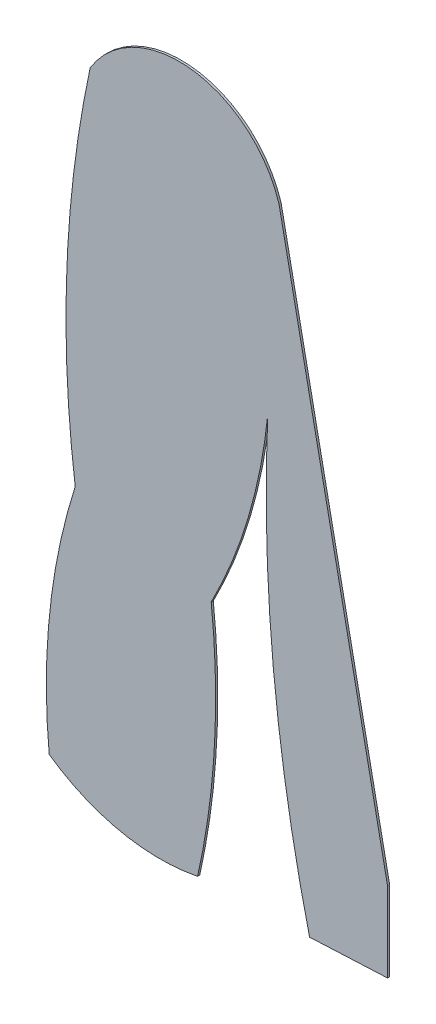
ISO-10303-21;
HEADER;
FILE_DESCRIPTION(('STEP AP214'),'2;1');
FILE_NAME('part.step','',(''),(''),'','','');
FILE_SCHEMA(('AUTOMOTIVE_DESIGN { 1 0 10303 214 1 1 1 1 }'));
ENDSEC;
DATA;
#1=APPLICATION_CONTEXT('core data for automotive mechanical design processes');
#2=APPLICATION_PROTOCOL_DEFINITION('international standard','automotive_design',2000,#1);
#3=PRODUCT_CONTEXT('',#1,'mechanical');
#4=PRODUCT('Part','Part','',(#3));
#5=PRODUCT_RELATED_PRODUCT_CATEGORY('part','',(#4));
#6=PRODUCT_DEFINITION_FORMATION('','',#4);
#7=PRODUCT_DEFINITION_CONTEXT('part definition',#1,'design');
#8=PRODUCT_DEFINITION('design','',#6,#7);
#9=PRODUCT_DEFINITION_SHAPE('','',#8);
#10=(LENGTH_UNIT() NAMED_UNIT(*) SI_UNIT(.MILLI.,.METRE.));
#11=(NAMED_UNIT(*) PLANE_ANGLE_UNIT() SI_UNIT($,.RADIAN.));
#12=(NAMED_UNIT(*) SI_UNIT($,.STERADIAN.) SOLID_ANGLE_UNIT());
#13=UNCERTAINTY_MEASURE_WITH_UNIT(LENGTH_MEASURE(1.E-05),#10,'distance_accuracy_value','');
#14=(GEOMETRIC_REPRESENTATION_CONTEXT(3) GLOBAL_UNCERTAINTY_ASSIGNED_CONTEXT((#13)) GLOBAL_UNIT_ASSIGNED_CONTEXT((#10,
#11,#12)) REPRESENTATION_CONTEXT('',''));
#15=CARTESIAN_POINT('',(0.,0.,0.));
#16=DIRECTION('',(0.,0.,1.));
#17=DIRECTION('',(1.,0.,0.));
#18=AXIS2_PLACEMENT_3D('',#15,#16,#17);
#19=CARTESIAN_POINT('',(27.6029351162744,-1.12530536370908,0.1));
#20=DIRECTION('',(0.,0.,-1.));
#21=DIRECTION('',(-1.,0.,0.));
#22=AXIS2_PLACEMENT_3D('',#19,#20,#21);
#23=CYLINDRICAL_SURFACE('',#22,29.051276035575);
#24=CARTESIAN_POINT('',(27.6029351162744,-1.12530536370908,0.));
#25=DIRECTION('',(0.,0.,1.));
#26=DIRECTION('',(1.,0.,0.));
#27=AXIS2_PLACEMENT_3D('',#24,#25,#26);
#28=CIRCLE('',#27,29.051276035575);
#29=CARTESIAN_POINT('',(-0.0790372467822376,7.68860667273314,0.));
#30=VERTEX_POINT('',#29);
#31=CARTESIAN_POINT('',(-1.31247092155621,-3.93171462868826,0.));
#32=VERTEX_POINT('',#31);
#33=EDGE_CURVE('E141',#30,#32,#28,.T.);
#34=ORIENTED_EDGE('',*,*,#33,.T.);
#35=DIRECTION('',(0.,0.,-1.));
#36=VECTOR('',#35,1.);
#37=CARTESIAN_POINT('',(-1.31247092155621,-3.93171462868826,0.1));
#38=LINE('',#37,#36);
#39=CARTESIAN_POINT('',(-1.31247092155621,-3.93171462868826,0.1));
#40=VERTEX_POINT('',#39);
#41=EDGE_CURVE('E11',#40,#32,#38,.T.);
#42=ORIENTED_EDGE('',*,*,#41,.F.);
#43=CARTESIAN_POINT('',(27.6029351162744,-1.12530536370908,0.1));
#44=DIRECTION('',(0.,0.,1.));
#45=DIRECTION('',(1.,0.,0.));
#46=AXIS2_PLACEMENT_3D('',#43,#44,#45);
#47=CIRCLE('',#46,29.051276035575);
#48=CARTESIAN_POINT('',(-0.0790372467822376,7.68860667273314,0.1));
#49=VERTEX_POINT('',#48);
#50=EDGE_CURVE('E159',#49,#40,#47,.T.);
#51=ORIENTED_EDGE('',*,*,#50,.F.);
#52=DIRECTION('',(0.,0.,-1.));
#53=VECTOR('',#52,1.);
#54=CARTESIAN_POINT('',(-0.0790372467822376,7.68860667273314,0.1));
#55=LINE('',#54,#53);
#56=EDGE_CURVE('E137',#49,#30,#55,.T.);
#57=ORIENTED_EDGE('',*,*,#56,.T.);
#58=EDGE_LOOP('',(#34,#42,#51,#57));
#59=FACE_BOUND('',#58,.T.);
#60=ADVANCED_FACE('F33',(#59),#23,.T.);
#61=CARTESIAN_POINT('',(3.94281642629015,3.52855879331752,0.1));
#62=DIRECTION('',(0.,0.,-1.));
#63=DIRECTION('',(-1.,0.,0.));
#64=AXIS2_PLACEMENT_3D('',#61,#62,#63);
#65=CYLINDRICAL_SURFACE('',#64,9.12544380507161);
#66=CARTESIAN_POINT('',(3.94281642629015,3.52855879331752,0.));
#67=DIRECTION('',(0.,0.,1.));
#68=DIRECTION('',(1.,0.,0.));
#69=AXIS2_PLACEMENT_3D('',#66,#67,#68);
#70=CIRCLE('',#69,9.12544380507161);
#71=CARTESIAN_POINT('',(5.72661164172436,-5.42084338051029,0.));
#72=VERTEX_POINT('',#71);
#73=EDGE_CURVE('E144',#32,#72,#70,.T.);
#74=ORIENTED_EDGE('',*,*,#73,.T.);
#75=DIRECTION('',(0.,0.,-1.));
#76=VECTOR('',#75,1.);
#77=CARTESIAN_POINT('',(5.72661164172436,-5.42084338051029,0.1));
#78=LINE('',#77,#76);
#79=CARTESIAN_POINT('',(5.72661164172436,-5.42084338051029,0.1));
#80=VERTEX_POINT('',#79);
#81=EDGE_CURVE('E41',#80,#72,#78,.T.);
#82=ORIENTED_EDGE('',*,*,#81,.F.);
#83=CARTESIAN_POINT('',(3.94281642629015,3.52855879331752,0.1));
#84=DIRECTION('',(0.,0.,1.));
#85=DIRECTION('',(1.,0.,0.));
#86=AXIS2_PLACEMENT_3D('',#83,#84,#85);
#87=CIRCLE('',#86,9.12544380507161);
#88=EDGE_CURVE('E98',#40,#80,#87,.T.);
#89=ORIENTED_EDGE('',*,*,#88,.F.);
#90=ORIENTED_EDGE('',*,*,#41,.T.);
#91=EDGE_LOOP('',(#74,#82,#89,#90));
#92=FACE_BOUND('',#91,.T.);
#93=ADVANCED_FACE('F208',(#92),#65,.T.);
#94=CARTESIAN_POINT('',(-28.8733615968749,2.31607077777754,0.1));
#95=DIRECTION('',(0.,0.,-1.));
#96=DIRECTION('',(-1.,0.,0.));
#97=AXIS2_PLACEMENT_3D('',#94,#95,#96);
#98=CYLINDRICAL_SURFACE('',#97,35.4544494923346);
#99=CARTESIAN_POINT('',(-28.8733615968749,2.31607077777754,0.));
#100=DIRECTION('',(0.,0.,1.));
#101=DIRECTION('',(1.,0.,0.));
#102=AXIS2_PLACEMENT_3D('',#99,#100,#101);
#103=CIRCLE('',#102,35.4544494923346);
#104=CARTESIAN_POINT('',(6.37117830799491,6.16839419339819,0.));
#105=VERTEX_POINT('',#104);
#106=EDGE_CURVE('E146',#72,#105,#103,.T.);
#107=ORIENTED_EDGE('',*,*,#106,.T.);
#108=DIRECTION('',(0.,0.,-1.));
#109=VECTOR('',#108,1.);
#110=CARTESIAN_POINT('',(6.37117830799491,6.16839419339819,0.1));
#111=LINE('',#110,#109);
#112=CARTESIAN_POINT('',(6.37117830799491,6.16839419339819,0.1));
#113=VERTEX_POINT('',#112);
#114=EDGE_CURVE('E172',#113,#105,#111,.T.);
#115=ORIENTED_EDGE('',*,*,#114,.F.);
#116=CARTESIAN_POINT('',(-28.8733615968749,2.31607077777754,0.1));
#117=DIRECTION('',(0.,0.,1.));
#118=DIRECTION('',(1.,0.,0.));
#119=AXIS2_PLACEMENT_3D('',#116,#117,#118);
#120=CIRCLE('',#119,35.4544494923346);
#121=EDGE_CURVE('E180',#80,#113,#120,.T.);
#122=ORIENTED_EDGE('',*,*,#121,.F.);
#123=ORIENTED_EDGE('',*,*,#81,.T.);
#124=EDGE_LOOP('',(#107,#115,#122,#123));
#125=FACE_BOUND('',#124,.T.);
#126=ADVANCED_FACE('F178',(#125),#98,.T.);
#127=CARTESIAN_POINT('',(-15.9933771732739,17.7204776562566,0.1));
#128=DIRECTION('',(0.,0.,-1.));
#129=DIRECTION('',(-1.,0.,0.));
#130=AXIS2_PLACEMENT_3D('',#127,#128,#129);
#131=CYLINDRICAL_SURFACE('',#130,25.1718885705384);
#132=CARTESIAN_POINT('',(-15.9933771732739,17.7204776562566,0.));
#133=DIRECTION('',(0.,0.,1.));
#134=DIRECTION('',(1.,0.,0.));
#135=AXIS2_PLACEMENT_3D('',#132,#133,#134);
#136=CIRCLE('',#135,25.1718885705384);
#137=CARTESIAN_POINT('',(9.05259312207818,15.2058512084636,0.));
#138=VERTEX_POINT('',#137);
#139=EDGE_CURVE('E148',#105,#138,#136,.T.);
#140=ORIENTED_EDGE('',*,*,#139,.T.);
#141=DIRECTION('',(0.,0.,-1.));
#142=VECTOR('',#141,1.);
#143=CARTESIAN_POINT('',(9.05259312207818,15.2058512084636,0.1));
#144=LINE('',#143,#142);
#145=CARTESIAN_POINT('',(9.05259312207818,15.2058512084636,0.1));
#146=VERTEX_POINT('',#145);
#147=EDGE_CURVE('E169',#146,#138,#144,.T.);
#148=ORIENTED_EDGE('',*,*,#147,.F.);
#149=CARTESIAN_POINT('',(-15.9933771732739,17.7204776562566,0.1));
#150=DIRECTION('',(0.,0.,1.));
#151=DIRECTION('',(1.,0.,0.));
#152=AXIS2_PLACEMENT_3D('',#149,#150,#151);
#153=CIRCLE('',#152,25.1718885705384);
#154=EDGE_CURVE('E198',#113,#146,#153,.T.);
#155=ORIENTED_EDGE('',*,*,#154,.F.);
#156=ORIENTED_EDGE('',*,*,#114,.T.);
#157=EDGE_LOOP('',(#140,#148,#155,#156));
#158=FACE_BOUND('',#157,.T.);
#159=ADVANCED_FACE('F189',(#158),#131,.T.);
#160=CARTESIAN_POINT('',(82.0220836754828,11.9495556707479,0.1));
#161=DIRECTION('',(0.,0.,-1.));
#162=DIRECTION('',(-1.,0.,0.));
#163=AXIS2_PLACEMENT_3D('',#160,#161,#162);
#164=CYLINDRICAL_SURFACE('',#163,73.0421112253223);
#165=CARTESIAN_POINT('',(82.0220836754828,11.9495556707479,0.));
#166=DIRECTION('',(0.,0.,1.));
#167=DIRECTION('',(1.,0.,0.));
#168=AXIS2_PLACEMENT_3D('',#165,#166,#167);
#169=CIRCLE('',#168,73.0421112253223);
#170=CARTESIAN_POINT('',(11.037087709004,-5.26324072877236,0.));
#171=VERTEX_POINT('',#170);
#172=EDGE_CURVE('E150',#138,#171,#169,.T.);
#173=ORIENTED_EDGE('',*,*,#172,.T.);
#174=DIRECTION('',(0.,0.,-1.));
#175=VECTOR('',#174,1.);
#176=CARTESIAN_POINT('',(11.037087709004,-5.26324072877236,0.1));
#177=LINE('',#176,#175);
#178=CARTESIAN_POINT('',(11.037087709004,-5.26324072877236,0.1));
#179=VERTEX_POINT('',#178);
#180=EDGE_CURVE('E166',#179,#171,#177,.T.);
#181=ORIENTED_EDGE('',*,*,#180,.F.);
#182=CARTESIAN_POINT('',(82.0220836754828,11.9495556707479,0.1));
#183=DIRECTION('',(0.,0.,1.));
#184=DIRECTION('',(1.,0.,0.));
#185=AXIS2_PLACEMENT_3D('',#182,#183,#184);
#186=CIRCLE('',#185,73.0421112253223);
#187=EDGE_CURVE('E195',#146,#179,#186,.T.);
#188=ORIENTED_EDGE('',*,*,#187,.F.);
#189=ORIENTED_EDGE('',*,*,#147,.T.);
#190=EDGE_LOOP('',(#173,#181,#188,#189));
#191=FACE_BOUND('',#190,.T.);
#192=ADVANCED_FACE('F193',(#191),#164,.T.);
#193=CARTESIAN_POINT('',(14.7348181349545,-5.09127837500175,0.1));
#194=DIRECTION('',(-0.0464546312392883,0.99892040085105,0.));
#195=DIRECTION('',(-0.99892040085105,-0.0464546312392883,0.));
#196=AXIS2_PLACEMENT_3D('',#193,#194,#195);
#197=PLANE('',#196);
#198=DIRECTION('',(0.99892040085105,0.0464546312392883,0.));
#199=VECTOR('',#198,1.);
#200=CARTESIAN_POINT('',(14.7348181349545,-5.09127837500175,0.));
#201=LINE('',#200,#199);
#202=CARTESIAN_POINT('',(14.7348181349545,-5.09127837500175,0.));
#203=VERTEX_POINT('',#202);
#204=EDGE_CURVE('E152',#171,#203,#201,.T.);
#205=ORIENTED_EDGE('',*,*,#204,.T.);
#206=DIRECTION('',(0.,0.,-1.));
#207=VECTOR('',#206,1.);
#208=CARTESIAN_POINT('',(14.7348181349545,-5.09127837500175,0.1));
#209=LINE('',#208,#207);
#210=CARTESIAN_POINT('',(14.7348181349545,-5.09127837500175,0.1));
#211=VERTEX_POINT('',#210);
#212=EDGE_CURVE('E163',#211,#203,#209,.T.);
#213=ORIENTED_EDGE('',*,*,#212,.F.);
#214=DIRECTION('',(0.99892040085105,0.0464546312392883,0.));
#215=VECTOR('',#214,1.);
#216=CARTESIAN_POINT('',(14.7348181349545,-5.09127837500175,0.1));
#217=LINE('',#216,#215);
#218=EDGE_CURVE('E197',#179,#211,#217,.T.);
#219=ORIENTED_EDGE('',*,*,#218,.F.);
#220=ORIENTED_EDGE('',*,*,#180,.T.);
#221=EDGE_LOOP('',(#205,#213,#219,#220));
#222=FACE_BOUND('',#221,.T.);
#223=ADVANCED_FACE('F220',(#222),#197,.F.);
#224=CARTESIAN_POINT('',(14.7348181349545,-5.09127837500175,0.1));
#225=DIRECTION('',(-1.,0.,0.));
#226=DIRECTION('',(0.,-1.,0.));
#227=AXIS2_PLACEMENT_3D('',#224,#225,#226);
#228=PLANE('',#227);
#229=DIRECTION('',(0.,1.,0.));
#230=VECTOR('',#229,1.);
#231=CARTESIAN_POINT('',(14.7348181349545,-5.09127837500175,0.));
#232=LINE('',#231,#230);
#233=CARTESIAN_POINT('',(14.7348181349545,-1.30379545442513,0.));
#234=VERTEX_POINT('',#233);
#235=EDGE_CURVE('E154',#203,#234,#232,.T.);
#236=ORIENTED_EDGE('',*,*,#235,.T.);
#237=DIRECTION('',(0.,0.,-1.));
#238=VECTOR('',#237,1.);
#239=CARTESIAN_POINT('',(14.7348181349545,-1.30379545442513,0.1));
#240=LINE('',#239,#238);
#241=CARTESIAN_POINT('',(14.7348181349545,-1.30379545442513,0.1));
#242=VERTEX_POINT('',#241);
#243=EDGE_CURVE('E132',#242,#234,#240,.T.);
#244=ORIENTED_EDGE('',*,*,#243,.F.);
#245=DIRECTION('',(0.,1.,0.));
#246=VECTOR('',#245,1.);
#247=CARTESIAN_POINT('',(14.7348181349545,-5.09127837500175,0.1));
#248=LINE('',#247,#246);
#249=EDGE_CURVE('E123',#211,#242,#248,.T.);
#250=ORIENTED_EDGE('',*,*,#249,.F.);
#251=ORIENTED_EDGE('',*,*,#212,.T.);
#252=EDGE_LOOP('',(#236,#244,#250,#251));
#253=FACE_BOUND('',#252,.T.);
#254=ADVANCED_FACE('F223',(#253),#228,.F.);
#255=CARTESIAN_POINT('',(9.58612598334042,24.1332255948705,0.1));
#256=DIRECTION('',(-0.980123910113362,-0.198386291925867,0.));
#257=DIRECTION('',(0.198386291925867,-0.980123910113362,0.));
#258=AXIS2_PLACEMENT_3D('',#255,#256,#257);
#259=PLANE('',#258);
#260=DIRECTION('',(-0.198386291925867,0.980123910113362,0.));
#261=VECTOR('',#260,1.);
#262=CARTESIAN_POINT('',(9.58612598334042,24.1332255948705,0.));
#263=LINE('',#262,#261);
#264=CARTESIAN_POINT('',(9.58612598334042,24.1332255948705,0.));
#265=VERTEX_POINT('',#264);
#266=EDGE_CURVE('E131',#234,#265,#263,.T.);
#267=ORIENTED_EDGE('',*,*,#266,.T.);
#268=DIRECTION('',(0.,0.,-1.));
#269=VECTOR('',#268,1.);
#270=CARTESIAN_POINT('',(9.58612598334042,24.1332255948705,0.1));
#271=LINE('',#270,#269);
#272=CARTESIAN_POINT('',(9.58612598334042,24.1332255948705,0.1));
#273=VERTEX_POINT('',#272);
#274=EDGE_CURVE('E128',#273,#265,#271,.T.);
#275=ORIENTED_EDGE('',*,*,#274,.F.);
#276=DIRECTION('',(-0.198386291925867,0.980123910113362,0.));
#277=VECTOR('',#276,1.);
#278=CARTESIAN_POINT('',(9.58612598334042,24.1332255948705,0.1));
#279=LINE('',#278,#277);
#280=EDGE_CURVE('E117',#242,#273,#279,.T.);
#281=ORIENTED_EDGE('',*,*,#280,.F.);
#282=ORIENTED_EDGE('',*,*,#243,.T.);
#283=EDGE_LOOP('',(#267,#275,#281,#282));
#284=FACE_BOUND('',#283,.T.);
#285=ADVANCED_FACE('F129',(#284),#259,.F.);
#286=CARTESIAN_POINT('',(4.85750321932073,22.6692743671847,0.1));
#287=DIRECTION('',(0.,0.,-1.));
#288=DIRECTION('',(-1.,0.,0.));
#289=AXIS2_PLACEMENT_3D('',#286,#287,#288);
#290=CYLINDRICAL_SURFACE('',#289,4.95005317561822);
#291=CARTESIAN_POINT('',(4.85750321932073,22.6692743671847,0.));
#292=DIRECTION('',(0.,0.,1.));
#293=DIRECTION('',(1.,0.,0.));
#294=AXIS2_PLACEMENT_3D('',#291,#292,#293);
#295=CIRCLE('',#294,4.95005317561822);
#296=CARTESIAN_POINT('',(0.631193943688199,25.2463534013143,0.));
#297=VERTEX_POINT('',#296);
#298=EDGE_CURVE('E84',#265,#297,#295,.T.);
#299=ORIENTED_EDGE('',*,*,#298,.T.);
#300=DIRECTION('',(0.,0.,-1.));
#301=VECTOR('',#300,1.);
#302=CARTESIAN_POINT('',(0.631193943688199,25.2463534013143,0.1));
#303=LINE('',#302,#301);
#304=CARTESIAN_POINT('',(0.631193943688199,25.2463534013143,0.1));
#305=VERTEX_POINT('',#304);
#306=EDGE_CURVE('E133',#305,#297,#303,.T.);
#307=ORIENTED_EDGE('',*,*,#306,.F.);
#308=CARTESIAN_POINT('',(4.85750321932073,22.6692743671847,0.1));
#309=DIRECTION('',(0.,0.,1.));
#310=DIRECTION('',(1.,0.,0.));
#311=AXIS2_PLACEMENT_3D('',#308,#309,#310);
#312=CIRCLE('',#311,4.95005317561822);
#313=EDGE_CURVE('E121',#273,#305,#312,.T.);
#314=ORIENTED_EDGE('',*,*,#313,.F.);
#315=ORIENTED_EDGE('',*,*,#274,.T.);
#316=EDGE_LOOP('',(#299,#307,#314,#315));
#317=FACE_BOUND('',#316,.T.);
#318=ADVANCED_FACE('F135',(#317),#290,.T.);
#319=CARTESIAN_POINT('',(51.2581318379593,14.4051969261997,0.1));
#320=DIRECTION('',(0.,0.,-1.));
#321=DIRECTION('',(-1.,0.,0.));
#322=AXIS2_PLACEMENT_3D('',#319,#320,#321);
#323=CYLINDRICAL_SURFACE('',#322,51.7746802430329);
#324=CARTESIAN_POINT('',(51.2581318379593,14.4051969261997,0.));
#325=DIRECTION('',(0.,0.,1.));
#326=DIRECTION('',(1.,0.,0.));
#327=AXIS2_PLACEMENT_3D('',#324,#325,#326);
#328=CIRCLE('',#327,51.7746802430329);
#329=EDGE_CURVE('E90',#297,#30,#328,.T.);
#330=ORIENTED_EDGE('',*,*,#329,.T.);
#331=ORIENTED_EDGE('',*,*,#56,.F.);
#332=CARTESIAN_POINT('',(51.2581318379593,14.4051969261997,0.1));
#333=DIRECTION('',(0.,0.,1.));
#334=DIRECTION('',(1.,0.,0.));
#335=AXIS2_PLACEMENT_3D('',#332,#333,#334);
#336=CIRCLE('',#335,51.7746802430329);
#337=EDGE_CURVE('E49',#305,#49,#336,.T.);
#338=ORIENTED_EDGE('',*,*,#337,.F.);
#339=ORIENTED_EDGE('',*,*,#306,.T.);
#340=EDGE_LOOP('',(#330,#331,#338,#339));
#341=FACE_BOUND('',#340,.T.);
#342=ADVANCED_FACE('F232',(#341),#323,.T.);
#343=CARTESIAN_POINT('',(27.6029351162744,-1.12530536370908,0.1));
#344=DIRECTION('',(0.,0.,1.));
#345=DIRECTION('',(1.,0.,0.));
#346=AXIS2_PLACEMENT_3D('',#343,#344,#345);
#347=PLANE('',#346);
#348=ORIENTED_EDGE('',*,*,#50,.T.);
#349=ORIENTED_EDGE('',*,*,#88,.T.);
#350=ORIENTED_EDGE('',*,*,#121,.T.);
#351=ORIENTED_EDGE('',*,*,#154,.T.);
#352=ORIENTED_EDGE('',*,*,#187,.T.);
#353=ORIENTED_EDGE('',*,*,#218,.T.);
#354=ORIENTED_EDGE('',*,*,#249,.T.);
#355=ORIENTED_EDGE('',*,*,#280,.T.);
#356=ORIENTED_EDGE('',*,*,#313,.T.);
#357=ORIENTED_EDGE('',*,*,#337,.T.);
#358=EDGE_LOOP('',(#348,#349,#350,#351,#352,#353,#354,#355,#356,#357));
#359=FACE_BOUND('',#358,.T.);
#360=ADVANCED_FACE('F119',(#359),#347,.T.);
#361=CARTESIAN_POINT('',(27.6029351162744,-1.12530536370908,0.));
#362=DIRECTION('',(0.,0.,1.));
#363=DIRECTION('',(1.,0.,0.));
#364=AXIS2_PLACEMENT_3D('',#361,#362,#363);
#365=PLANE('',#364);
#366=ORIENTED_EDGE('',*,*,#33,.F.);
#367=ORIENTED_EDGE('',*,*,#329,.F.);
#368=ORIENTED_EDGE('',*,*,#298,.F.);
#369=ORIENTED_EDGE('',*,*,#266,.F.);
#370=ORIENTED_EDGE('',*,*,#235,.F.);
#371=ORIENTED_EDGE('',*,*,#204,.F.);
#372=ORIENTED_EDGE('',*,*,#172,.F.);
#373=ORIENTED_EDGE('',*,*,#139,.F.);
#374=ORIENTED_EDGE('',*,*,#106,.F.);
#375=ORIENTED_EDGE('',*,*,#73,.F.);
#376=EDGE_LOOP('',(#366,#367,#368,#369,#370,#371,#372,#373,#374,#375));
#377=FACE_BOUND('',#376,.T.);
#378=ADVANCED_FACE('F184',(#377),#365,.F.);
#379=CLOSED_SHELL('',(#60,#93,#126,#159,#192,#223,#254,#285,#318,#342,#360,#378));
#380=MANIFOLD_SOLID_BREP('B2',#379);
#381=ADVANCED_BREP_SHAPE_REPRESENTATION('',(#18,#380),#14);
#382=SHAPE_DEFINITION_REPRESENTATION(#9,#381);
ENDSEC;
END-ISO-10303-21;
